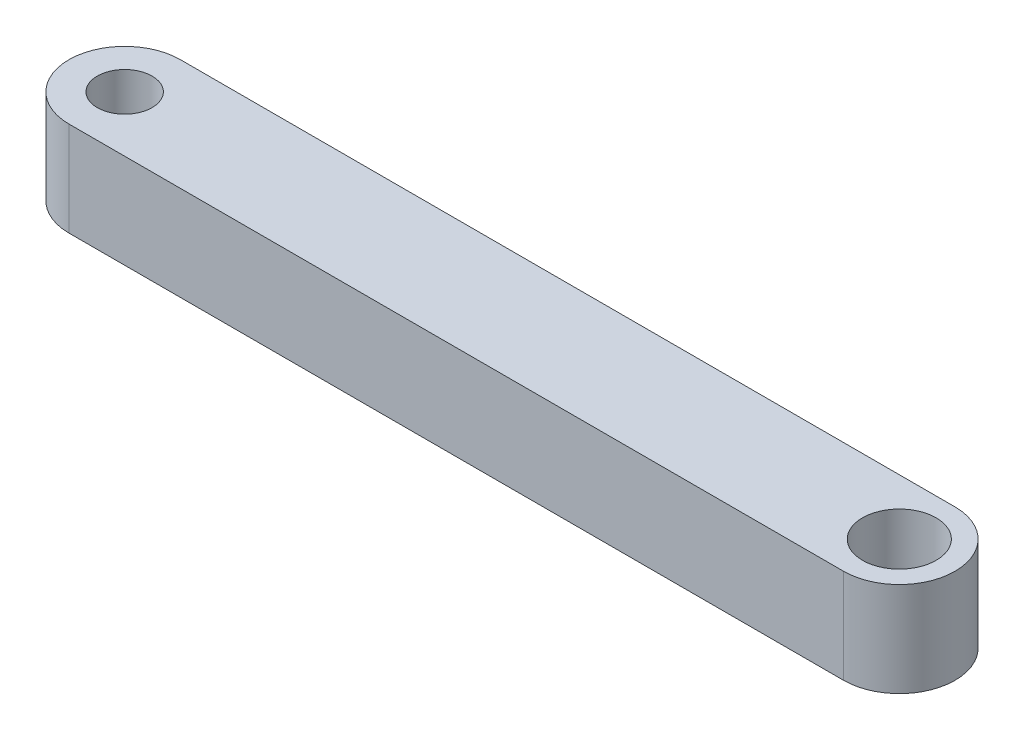
ISO-10303-21;
HEADER;
FILE_DESCRIPTION(('STEP AP214'),'2;1');
FILE_NAME('part.step','',(''),(''),'','','');
FILE_SCHEMA(('AUTOMOTIVE_DESIGN { 1 0 10303 214 1 1 1 1 }'));
ENDSEC;
DATA;
#1=APPLICATION_CONTEXT('core data for automotive mechanical design processes');
#2=APPLICATION_PROTOCOL_DEFINITION('international standard','automotive_design',2000,#1);
#3=PRODUCT_CONTEXT('',#1,'mechanical');
#4=PRODUCT('Part','Part','',(#3));
#5=PRODUCT_RELATED_PRODUCT_CATEGORY('part','',(#4));
#6=PRODUCT_DEFINITION_FORMATION('','',#4);
#7=PRODUCT_DEFINITION_CONTEXT('part definition',#1,'design');
#8=PRODUCT_DEFINITION('design','',#6,#7);
#9=PRODUCT_DEFINITION_SHAPE('','',#8);
#10=(LENGTH_UNIT() NAMED_UNIT(*) SI_UNIT(.MILLI.,.METRE.));
#11=(NAMED_UNIT(*) PLANE_ANGLE_UNIT() SI_UNIT($,.RADIAN.));
#12=(NAMED_UNIT(*) SI_UNIT($,.STERADIAN.) SOLID_ANGLE_UNIT());
#13=UNCERTAINTY_MEASURE_WITH_UNIT(LENGTH_MEASURE(1.E-05),#10,'distance_accuracy_value','');
#14=(GEOMETRIC_REPRESENTATION_CONTEXT(3) GLOBAL_UNCERTAINTY_ASSIGNED_CONTEXT((#13)) GLOBAL_UNIT_ASSIGNED_CONTEXT((#10,
#11,#12)) REPRESENTATION_CONTEXT('',''));
#15=CARTESIAN_POINT('',(0.,0.,0.));
#16=DIRECTION('',(0.,0.,1.));
#17=DIRECTION('',(1.,0.,0.));
#18=AXIS2_PLACEMENT_3D('',#15,#16,#17);
#19=CARTESIAN_POINT('',(32.,5.,0.));
#20=DIRECTION('',(0.,-1.,0.));
#21=DIRECTION('',(0.,0.,-1.));
#22=AXIS2_PLACEMENT_3D('',#19,#20,#21);
#23=CYLINDRICAL_SURFACE('',#22,2.95);
#24=CARTESIAN_POINT('',(32.,0.,0.));
#25=DIRECTION('',(0.,-1.,0.));
#26=DIRECTION('',(0.,0.,-1.));
#27=AXIS2_PLACEMENT_3D('',#24,#25,#26);
#28=CIRCLE('',#27,2.95);
#29=CARTESIAN_POINT('',(32.,0.,-2.95));
#30=VERTEX_POINT('',#29);
#31=CARTESIAN_POINT('',(32.,0.,2.95));
#32=VERTEX_POINT('',#31);
#33=EDGE_CURVE('E100',#30,#32,#28,.T.);
#34=ORIENTED_EDGE('',*,*,#33,.F.);
#35=DIRECTION('',(0.,-1.,0.));
#36=VECTOR('',#35,1.);
#37=CARTESIAN_POINT('',(32.,5.,-2.95));
#38=LINE('',#37,#36);
#39=CARTESIAN_POINT('',(32.,5.,-2.95));
#40=VERTEX_POINT('',#39);
#41=EDGE_CURVE('E11',#40,#30,#38,.T.);
#42=ORIENTED_EDGE('',*,*,#41,.F.);
#43=CARTESIAN_POINT('',(32.,5.,0.));
#44=DIRECTION('',(0.,-1.,0.));
#45=DIRECTION('',(0.,0.,-1.));
#46=AXIS2_PLACEMENT_3D('',#43,#44,#45);
#47=CIRCLE('',#46,2.95);
#48=CARTESIAN_POINT('',(32.,5.,2.95));
#49=VERTEX_POINT('',#48);
#50=EDGE_CURVE('E93',#40,#49,#47,.T.);
#51=ORIENTED_EDGE('',*,*,#50,.T.);
#52=DIRECTION('',(0.,-1.,0.));
#53=VECTOR('',#52,1.);
#54=CARTESIAN_POINT('',(32.,5.,2.95));
#55=LINE('',#54,#53);
#56=EDGE_CURVE('E38',#49,#32,#55,.T.);
#57=ORIENTED_EDGE('',*,*,#56,.T.);
#58=EDGE_LOOP('',(#34,#42,#51,#57));
#59=FACE_BOUND('',#58,.T.);
#60=ADVANCED_FACE('F35',(#59),#23,.T.);
#61=CARTESIAN_POINT('',(-9.,5.,-2.95));
#62=DIRECTION('',(0.,0.,-1.));
#63=DIRECTION('',(-1.,0.,0.));
#64=AXIS2_PLACEMENT_3D('',#61,#62,#63);
#65=PLANE('',#64);
#66=DIRECTION('',(1.,0.,0.));
#67=VECTOR('',#66,1.);
#68=CARTESIAN_POINT('',(-9.,0.,-2.95));
#69=LINE('',#68,#67);
#70=CARTESIAN_POINT('',(-9.,0.,-2.95));
#71=VERTEX_POINT('',#70);
#72=EDGE_CURVE('E95',#71,#30,#69,.T.);
#73=ORIENTED_EDGE('',*,*,#72,.F.);
#74=DIRECTION('',(0.,-1.,0.));
#75=VECTOR('',#74,1.);
#76=CARTESIAN_POINT('',(-9.,5.,-2.95));
#77=LINE('',#76,#75);
#78=CARTESIAN_POINT('',(-9.,5.,-2.95));
#79=VERTEX_POINT('',#78);
#80=EDGE_CURVE('E44',#79,#71,#77,.T.);
#81=ORIENTED_EDGE('',*,*,#80,.F.);
#82=DIRECTION('',(1.,0.,0.));
#83=VECTOR('',#82,1.);
#84=CARTESIAN_POINT('',(-9.,5.,-2.95));
#85=LINE('',#84,#83);
#86=EDGE_CURVE('E90',#79,#40,#85,.T.);
#87=ORIENTED_EDGE('',*,*,#86,.T.);
#88=ORIENTED_EDGE('',*,*,#41,.T.);
#89=EDGE_LOOP('',(#73,#81,#87,#88));
#90=FACE_BOUND('',#89,.T.);
#91=ADVANCED_FACE('F111',(#90),#65,.T.);
#92=CARTESIAN_POINT('',(-9.,5.,0.));
#93=DIRECTION('',(0.,-1.,0.));
#94=DIRECTION('',(0.,0.,-1.));
#95=AXIS2_PLACEMENT_3D('',#92,#93,#94);
#96=CYLINDRICAL_SURFACE('',#95,2.95);
#97=CARTESIAN_POINT('',(-9.,0.,0.));
#98=DIRECTION('',(0.,-1.,0.));
#99=DIRECTION('',(0.,0.,-1.));
#100=AXIS2_PLACEMENT_3D('',#97,#98,#99);
#101=CIRCLE('',#100,2.95);
#102=CARTESIAN_POINT('',(-9.,0.,2.95));
#103=VERTEX_POINT('',#102);
#104=EDGE_CURVE('E85',#103,#71,#101,.T.);
#105=ORIENTED_EDGE('',*,*,#104,.F.);
#106=DIRECTION('',(0.,-1.,0.));
#107=VECTOR('',#106,1.);
#108=CARTESIAN_POINT('',(-9.,5.,2.95));
#109=LINE('',#108,#107);
#110=CARTESIAN_POINT('',(-9.,5.,2.95));
#111=VERTEX_POINT('',#110);
#112=EDGE_CURVE('E80',#111,#103,#109,.T.);
#113=ORIENTED_EDGE('',*,*,#112,.F.);
#114=CARTESIAN_POINT('',(-9.,5.,0.));
#115=DIRECTION('',(0.,-1.,0.));
#116=DIRECTION('',(0.,0.,-1.));
#117=AXIS2_PLACEMENT_3D('',#114,#115,#116);
#118=CIRCLE('',#117,2.95);
#119=EDGE_CURVE('E83',#111,#79,#118,.T.);
#120=ORIENTED_EDGE('',*,*,#119,.T.);
#121=ORIENTED_EDGE('',*,*,#80,.T.);
#122=EDGE_LOOP('',(#105,#113,#120,#121));
#123=FACE_BOUND('',#122,.T.);
#124=ADVANCED_FACE('F82',(#123),#96,.T.);
#125=CARTESIAN_POINT('',(32.,5.,2.95));
#126=DIRECTION('',(0.,0.,1.));
#127=DIRECTION('',(1.,0.,0.));
#128=AXIS2_PLACEMENT_3D('',#125,#126,#127);
#129=PLANE('',#128);
#130=DIRECTION('',(-1.,0.,0.));
#131=VECTOR('',#130,1.);
#132=CARTESIAN_POINT('',(32.,0.,2.95));
#133=LINE('',#132,#131);
#134=EDGE_CURVE('E103',#32,#103,#133,.T.);
#135=ORIENTED_EDGE('',*,*,#134,.F.);
#136=ORIENTED_EDGE('',*,*,#56,.F.);
#137=DIRECTION('',(-1.,0.,0.));
#138=VECTOR('',#137,1.);
#139=CARTESIAN_POINT('',(32.,5.,2.95));
#140=LINE('',#139,#138);
#141=EDGE_CURVE('E89',#49,#111,#140,.T.);
#142=ORIENTED_EDGE('',*,*,#141,.T.);
#143=ORIENTED_EDGE('',*,*,#112,.T.);
#144=EDGE_LOOP('',(#135,#136,#142,#143));
#145=FACE_BOUND('',#144,.T.);
#146=ADVANCED_FACE('F92',(#145),#129,.T.);
#147=CARTESIAN_POINT('',(32.,5.,0.));
#148=DIRECTION('',(0.,-1.,0.));
#149=DIRECTION('',(0.,0.,-1.));
#150=AXIS2_PLACEMENT_3D('',#147,#148,#149);
#151=PLANE('',#150);
#152=CARTESIAN_POINT('',(-9.,5.,0.));
#153=DIRECTION('',(0.,-1.,0.));
#154=DIRECTION('',(0.,0.,1.));
#155=AXIS2_PLACEMENT_3D('',#152,#153,#154);
#156=CIRCLE('',#155,1.45);
#157=CARTESIAN_POINT('',(-9.,5.,1.45));
#158=VERTEX_POINT('',#157);
#159=EDGE_CURVE('E144',#158,#158,#156,.T.);
#160=ORIENTED_EDGE('',*,*,#159,.T.);
#161=EDGE_LOOP('',(#160));
#162=FACE_BOUND('',#161,.T.);
#163=CARTESIAN_POINT('',(32.,5.,0.));
#164=DIRECTION('',(0.,-1.,0.));
#165=DIRECTION('',(0.,0.,1.));
#166=AXIS2_PLACEMENT_3D('',#163,#164,#165);
#167=CIRCLE('',#166,1.95);
#168=CARTESIAN_POINT('',(32.,5.,1.95));
#169=VERTEX_POINT('',#168);
#170=EDGE_CURVE('E104',#169,#169,#167,.T.);
#171=ORIENTED_EDGE('',*,*,#170,.T.);
#172=EDGE_LOOP('',(#171));
#173=FACE_BOUND('',#172,.T.);
#174=ORIENTED_EDGE('',*,*,#50,.F.);
#175=ORIENTED_EDGE('',*,*,#86,.F.);
#176=ORIENTED_EDGE('',*,*,#119,.F.);
#177=ORIENTED_EDGE('',*,*,#141,.F.);
#178=EDGE_LOOP('',(#174,#175,#176,#177));
#179=FACE_BOUND('',#178,.T.);
#180=ADVANCED_FACE('F88',(#162,#173,#179),#151,.F.);
#181=CARTESIAN_POINT('',(32.,0.,0.));
#182=DIRECTION('',(0.,-1.,0.));
#183=DIRECTION('',(0.,0.,-1.));
#184=AXIS2_PLACEMENT_3D('',#181,#182,#183);
#185=PLANE('',#184);
#186=CARTESIAN_POINT('',(-9.,0.,0.));
#187=DIRECTION('',(0.,-1.,0.));
#188=DIRECTION('',(0.,0.,1.));
#189=AXIS2_PLACEMENT_3D('',#186,#187,#188);
#190=CIRCLE('',#189,1.45);
#191=CARTESIAN_POINT('',(-9.,0.,1.45));
#192=VERTEX_POINT('',#191);
#193=EDGE_CURVE('E147',#192,#192,#190,.T.);
#194=ORIENTED_EDGE('',*,*,#193,.F.);
#195=EDGE_LOOP('',(#194));
#196=FACE_BOUND('',#195,.T.);
#197=CARTESIAN_POINT('',(32.,0.,0.));
#198=DIRECTION('',(0.,-1.,0.));
#199=DIRECTION('',(0.,0.,1.));
#200=AXIS2_PLACEMENT_3D('',#197,#198,#199);
#201=CIRCLE('',#200,1.95);
#202=CARTESIAN_POINT('',(32.,0.,1.95));
#203=VERTEX_POINT('',#202);
#204=EDGE_CURVE('E149',#203,#203,#201,.T.);
#205=ORIENTED_EDGE('',*,*,#204,.F.);
#206=EDGE_LOOP('',(#205));
#207=FACE_BOUND('',#206,.T.);
#208=ORIENTED_EDGE('',*,*,#33,.T.);
#209=ORIENTED_EDGE('',*,*,#134,.T.);
#210=ORIENTED_EDGE('',*,*,#104,.T.);
#211=ORIENTED_EDGE('',*,*,#72,.T.);
#212=EDGE_LOOP('',(#208,#209,#210,#211));
#213=FACE_BOUND('',#212,.T.);
#214=ADVANCED_FACE('F110',(#196,#207,#213),#185,.T.);
#215=CARTESIAN_POINT('',(32.,5.,0.));
#216=DIRECTION('',(0.,-1.,0.));
#217=DIRECTION('',(0.,0.,-1.));
#218=AXIS2_PLACEMENT_3D('',#215,#216,#217);
#219=CYLINDRICAL_SURFACE('',#218,1.95);
#220=ORIENTED_EDGE('',*,*,#170,.F.);
#221=EDGE_LOOP('',(#220));
#222=FACE_BOUND('',#221,.T.);
#223=ORIENTED_EDGE('',*,*,#204,.T.);
#224=EDGE_LOOP('',(#223));
#225=FACE_BOUND('',#224,.T.);
#226=ADVANCED_FACE('F129',(#222,#225),#219,.F.);
#227=CARTESIAN_POINT('',(-9.,5.,0.));
#228=DIRECTION('',(0.,-1.,0.));
#229=DIRECTION('',(0.,0.,-1.));
#230=AXIS2_PLACEMENT_3D('',#227,#228,#229);
#231=CYLINDRICAL_SURFACE('',#230,1.45);
#232=ORIENTED_EDGE('',*,*,#159,.F.);
#233=EDGE_LOOP('',(#232));
#234=FACE_BOUND('',#233,.T.);
#235=ORIENTED_EDGE('',*,*,#193,.T.);
#236=EDGE_LOOP('',(#235));
#237=FACE_BOUND('',#236,.T.);
#238=ADVANCED_FACE('F136',(#234,#237),#231,.F.);
#239=CLOSED_SHELL('',(#60,#91,#124,#146,#180,#214,#226,#238));
#240=MANIFOLD_SOLID_BREP('B2',#239);
#241=ADVANCED_BREP_SHAPE_REPRESENTATION('',(#18,#240),#14);
#242=SHAPE_DEFINITION_REPRESENTATION(#9,#241);
ENDSEC;
END-ISO-10303-21;
